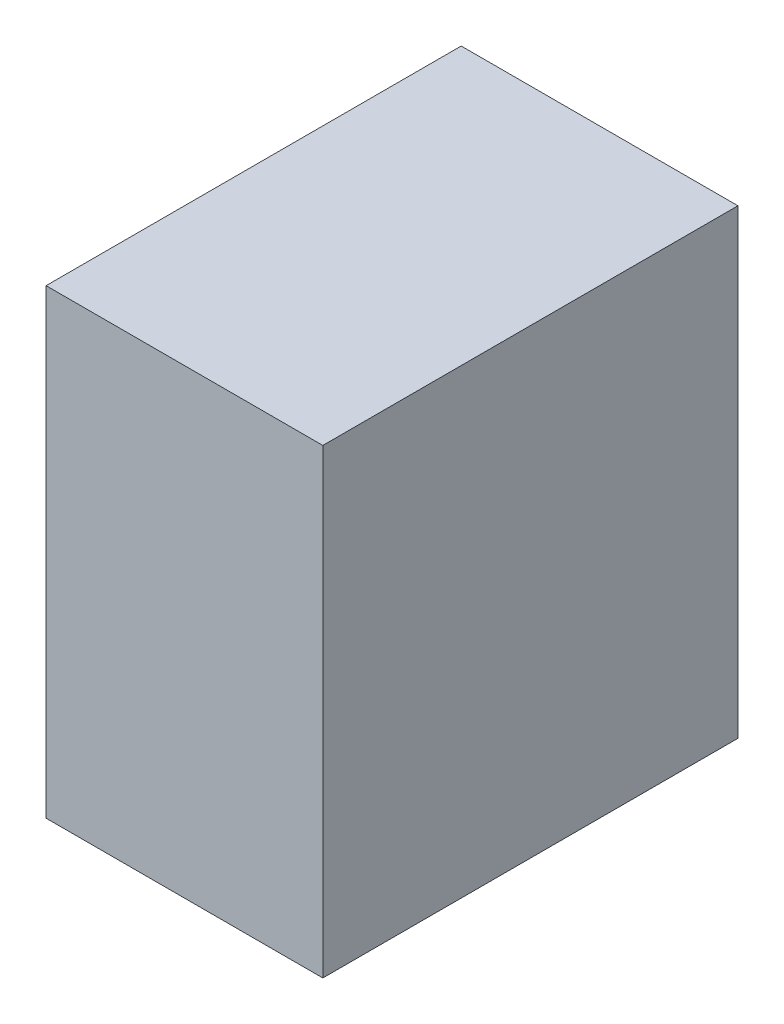
ISO-10303-21;
HEADER;
FILE_DESCRIPTION(('STEP AP214'),'2;1');
FILE_NAME('part.step','',(''),(''),'','','');
FILE_SCHEMA(('AUTOMOTIVE_DESIGN { 1 0 10303 214 1 1 1 1 }'));
ENDSEC;
DATA;
#1=APPLICATION_CONTEXT('core data for automotive mechanical design processes');
#2=APPLICATION_PROTOCOL_DEFINITION('international standard','automotive_design',2000,#1);
#3=PRODUCT_CONTEXT('',#1,'mechanical');
#4=PRODUCT('Part','Part','',(#3));
#5=PRODUCT_RELATED_PRODUCT_CATEGORY('part','',(#4));
#6=PRODUCT_DEFINITION_FORMATION('','',#4);
#7=PRODUCT_DEFINITION_CONTEXT('part definition',#1,'design');
#8=PRODUCT_DEFINITION('design','',#6,#7);
#9=PRODUCT_DEFINITION_SHAPE('','',#8);
#10=(LENGTH_UNIT() NAMED_UNIT(*) SI_UNIT(.MILLI.,.METRE.));
#11=(NAMED_UNIT(*) PLANE_ANGLE_UNIT() SI_UNIT($,.RADIAN.));
#12=(NAMED_UNIT(*) SI_UNIT($,.STERADIAN.) SOLID_ANGLE_UNIT());
#13=UNCERTAINTY_MEASURE_WITH_UNIT(LENGTH_MEASURE(1.E-05),#10,'distance_accuracy_value','');
#14=(GEOMETRIC_REPRESENTATION_CONTEXT(3) GLOBAL_UNCERTAINTY_ASSIGNED_CONTEXT((#13)) GLOBAL_UNIT_ASSIGNED_CONTEXT((#10,
#11,#12)) REPRESENTATION_CONTEXT('',''));
#15=CARTESIAN_POINT('',(0.,0.,0.));
#16=DIRECTION('',(0.,0.,1.));
#17=DIRECTION('',(1.,0.,0.));
#18=AXIS2_PLACEMENT_3D('',#15,#16,#17);
#19=CARTESIAN_POINT('',(-3.3,-1.8000002141858,-3.30112167835709));
#20=DIRECTION('',(1.,0.,0.));
#21=DIRECTION('',(0.,1.,8.74227765734759E-08));
#22=AXIS2_PLACEMENT_3D('',#19,#20,#21);
#23=PLANE('',#22);
#24=DIRECTION('',(0.,-8.74227771655945E-08,0.999999999999996));
#25=VECTOR('',#24,1.);
#26=CARTESIAN_POINT('',(-3.3,-0.750000218554941,-3.25112158656318));
#27=LINE('',#26,#25);
#28=CARTESIAN_POINT('',(-3.300000000001,-0.750000218554942,-3.25112158656218));
#29=VERTEX_POINT('',#28);
#30=CARTESIAN_POINT('',(-3.300000000001,-0.75000029723644,-2.35112158656318));
#31=VERTEX_POINT('',#30);
#32=EDGE_CURVE('E11',#29,#31,#27,.T.);
#33=ORIENTED_EDGE('',*,*,#32,.T.);
#34=DIRECTION('',(0.,-0.999999999999996,-8.74227765733006E-08));
#35=VECTOR('',#34,1.);
#36=CARTESIAN_POINT('',(-3.3,-0.75000029723544,-2.35112158656318));
#37=LINE('',#36,#35);
#38=CARTESIAN_POINT('',(-3.300000000001,-1.75000029723744,-2.35112167398695));
#39=VERTEX_POINT('',#38);
#40=EDGE_CURVE('E69',#31,#39,#37,.T.);
#41=ORIENTED_EDGE('',*,*,#40,.T.);
#42=DIRECTION('',(0.,8.7422776672162E-08,-0.999999999999996));
#43=VECTOR('',#42,1.);
#44=CARTESIAN_POINT('',(-3.3,-1.75000029723744,-2.35112167398595));
#45=LINE('',#44,#43);
#46=CARTESIAN_POINT('',(-3.300000000001,-1.75000021855594,-3.25112167398595));
#47=VERTEX_POINT('',#46);
#48=EDGE_CURVE('E55',#39,#47,#45,.T.);
#49=ORIENTED_EDGE('',*,*,#48,.T.);
#50=DIRECTION('',(0.,0.999999999999996,8.74227765733007E-08));
#51=VECTOR('',#50,1.);
#52=CARTESIAN_POINT('',(-3.3,-1.75000021855694,-3.25112167398595));
#53=LINE('',#52,#51);
#54=EDGE_CURVE('E53',#47,#29,#53,.T.);
#55=ORIENTED_EDGE('',*,*,#54,.T.);
#56=EDGE_LOOP('',(#33,#41,#49,#55));
#57=FACE_BOUND('',#56,.T.);
#58=ADVANCED_FACE('F17',(#57),#23,.T.);
#59=CARTESIAN_POINT('',(-3.9,-1.8000002141858,-3.30112167835709));
#60=DIRECTION('',(1.,0.,0.));
#61=DIRECTION('',(0.,1.,8.74227765734759E-08));
#62=AXIS2_PLACEMENT_3D('',#59,#60,#61);
#63=PLANE('',#62);
#64=DIRECTION('',(0.,0.999999999999996,8.74227765733007E-08));
#65=VECTOR('',#64,1.);
#66=CARTESIAN_POINT('',(-3.9,-1.75000021855694,-3.25112167398595));
#67=LINE('',#66,#65);
#68=CARTESIAN_POINT('',(-3.899999999999,-1.75000021855594,-3.25112167398595));
#69=VERTEX_POINT('',#68);
#70=CARTESIAN_POINT('',(-3.899999999999,-0.750000218554942,-3.25112158656218));
#71=VERTEX_POINT('',#70);
#72=EDGE_CURVE('E24',#69,#71,#67,.T.);
#73=ORIENTED_EDGE('',*,*,#72,.F.);
#74=DIRECTION('',(0.,8.7422776672162E-08,-0.999999999999996));
#75=VECTOR('',#74,1.);
#76=CARTESIAN_POINT('',(-3.9,-1.75000029723744,-2.35112167398595));
#77=LINE('',#76,#75);
#78=CARTESIAN_POINT('',(-3.899999999999,-1.75000029723744,-2.35112167398695));
#79=VERTEX_POINT('',#78);
#80=EDGE_CURVE('E70',#79,#69,#77,.T.);
#81=ORIENTED_EDGE('',*,*,#80,.F.);
#82=DIRECTION('',(0.,-0.999999999999996,-8.74227765733007E-08));
#83=VECTOR('',#82,1.);
#84=CARTESIAN_POINT('',(-3.9,-0.75000029723544,-2.35112158656318));
#85=LINE('',#84,#83);
#86=CARTESIAN_POINT('',(-3.899999999999,-0.75000029723644,-2.35112158656318));
#87=VERTEX_POINT('',#86);
#88=EDGE_CURVE('E59',#87,#79,#85,.T.);
#89=ORIENTED_EDGE('',*,*,#88,.F.);
#90=DIRECTION('',(0.,-8.74227765488039E-08,0.999999999999996));
#91=VECTOR('',#90,1.);
#92=CARTESIAN_POINT('',(-3.9,-0.750000218554942,-3.25112158656318));
#93=LINE('',#92,#91);
#94=EDGE_CURVE('E78',#71,#87,#93,.T.);
#95=ORIENTED_EDGE('',*,*,#94,.F.);
#96=EDGE_LOOP('',(#73,#81,#89,#95));
#97=FACE_BOUND('',#96,.T.);
#98=ADVANCED_FACE('F89',(#97),#63,.F.);
#99=CARTESIAN_POINT('',(-3.3,-0.750000218554942,-3.25112158656318));
#100=DIRECTION('',(0.,-1.,-8.74227765734759E-08));
#101=DIRECTION('',(0.,-8.74227765734759E-08,1.));
#102=AXIS2_PLACEMENT_3D('',#99,#100,#101);
#103=PLANE('',#102);
#104=DIRECTION('',(-1.,0.,0.));
#105=VECTOR('',#104,1.);
#106=CARTESIAN_POINT('',(-3.3,-0.750000218554942,-3.25112158656318));
#107=LINE('',#106,#105);
#108=EDGE_CURVE('E65',#29,#71,#107,.T.);
#109=ORIENTED_EDGE('',*,*,#108,.T.);
#110=ORIENTED_EDGE('',*,*,#94,.T.);
#111=DIRECTION('',(-1.,0.,0.));
#112=VECTOR('',#111,1.);
#113=CARTESIAN_POINT('',(-3.3,-0.75000029723544,-2.35112158656318));
#114=LINE('',#113,#112);
#115=EDGE_CURVE('E66',#31,#87,#114,.T.);
#116=ORIENTED_EDGE('',*,*,#115,.F.);
#117=ORIENTED_EDGE('',*,*,#32,.F.);
#118=EDGE_LOOP('',(#109,#110,#116,#117));
#119=FACE_BOUND('',#118,.T.);
#120=ADVANCED_FACE('F63',(#119),#103,.F.);
#121=CARTESIAN_POINT('',(-3.3,-0.75000029723544,-2.35112158656318));
#122=DIRECTION('',(0.,8.74227765734759E-08,-1.));
#123=DIRECTION('',(0.,-1.,-8.74227765734759E-08));
#124=AXIS2_PLACEMENT_3D('',#121,#122,#123);
#125=PLANE('',#124);
#126=ORIENTED_EDGE('',*,*,#115,.T.);
#127=ORIENTED_EDGE('',*,*,#88,.T.);
#128=DIRECTION('',(-1.,0.,0.));
#129=VECTOR('',#128,1.);
#130=CARTESIAN_POINT('',(-3.3,-1.75000029723744,-2.35112167398595));
#131=LINE('',#130,#129);
#132=EDGE_CURVE('E60',#39,#79,#131,.T.);
#133=ORIENTED_EDGE('',*,*,#132,.F.);
#134=ORIENTED_EDGE('',*,*,#40,.F.);
#135=EDGE_LOOP('',(#126,#127,#133,#134));
#136=FACE_BOUND('',#135,.T.);
#137=ADVANCED_FACE('F91',(#136),#125,.F.);
#138=CARTESIAN_POINT('',(-3.3,-1.75000029723744,-2.35112167398595));
#139=DIRECTION('',(0.,1.,8.74227765734759E-08));
#140=DIRECTION('',(0.,8.74227765734759E-08,-1.));
#141=AXIS2_PLACEMENT_3D('',#138,#139,#140);
#142=PLANE('',#141);
#143=ORIENTED_EDGE('',*,*,#132,.T.);
#144=ORIENTED_EDGE('',*,*,#80,.T.);
#145=DIRECTION('',(-1.,0.,0.));
#146=VECTOR('',#145,1.);
#147=CARTESIAN_POINT('',(-3.3,-1.75000021855694,-3.25112167398595));
#148=LINE('',#147,#146);
#149=EDGE_CURVE('E84',#47,#69,#148,.T.);
#150=ORIENTED_EDGE('',*,*,#149,.F.);
#151=ORIENTED_EDGE('',*,*,#48,.F.);
#152=EDGE_LOOP('',(#143,#144,#150,#151));
#153=FACE_BOUND('',#152,.T.);
#154=ADVANCED_FACE('F86',(#153),#142,.F.);
#155=CARTESIAN_POINT('',(-3.3,-1.75000021855694,-3.25112167398595));
#156=DIRECTION('',(0.,-8.74227765734759E-08,1.));
#157=DIRECTION('',(0.,1.,8.74227765734759E-08));
#158=AXIS2_PLACEMENT_3D('',#155,#156,#157);
#159=PLANE('',#158);
#160=ORIENTED_EDGE('',*,*,#149,.T.);
#161=ORIENTED_EDGE('',*,*,#72,.T.);
#162=ORIENTED_EDGE('',*,*,#108,.F.);
#163=ORIENTED_EDGE('',*,*,#54,.F.);
#164=EDGE_LOOP('',(#160,#161,#162,#163));
#165=FACE_BOUND('',#164,.T.);
#166=ADVANCED_FACE('F68',(#165),#159,.F.);
#167=CLOSED_SHELL('',(#58,#98,#120,#137,#154,#166));
#168=MANIFOLD_SOLID_BREP('B1',#167);
#169=ADVANCED_BREP_SHAPE_REPRESENTATION('',(#18,#168),#14);
#170=SHAPE_DEFINITION_REPRESENTATION(#9,#169);
ENDSEC;
END-ISO-10303-21;
